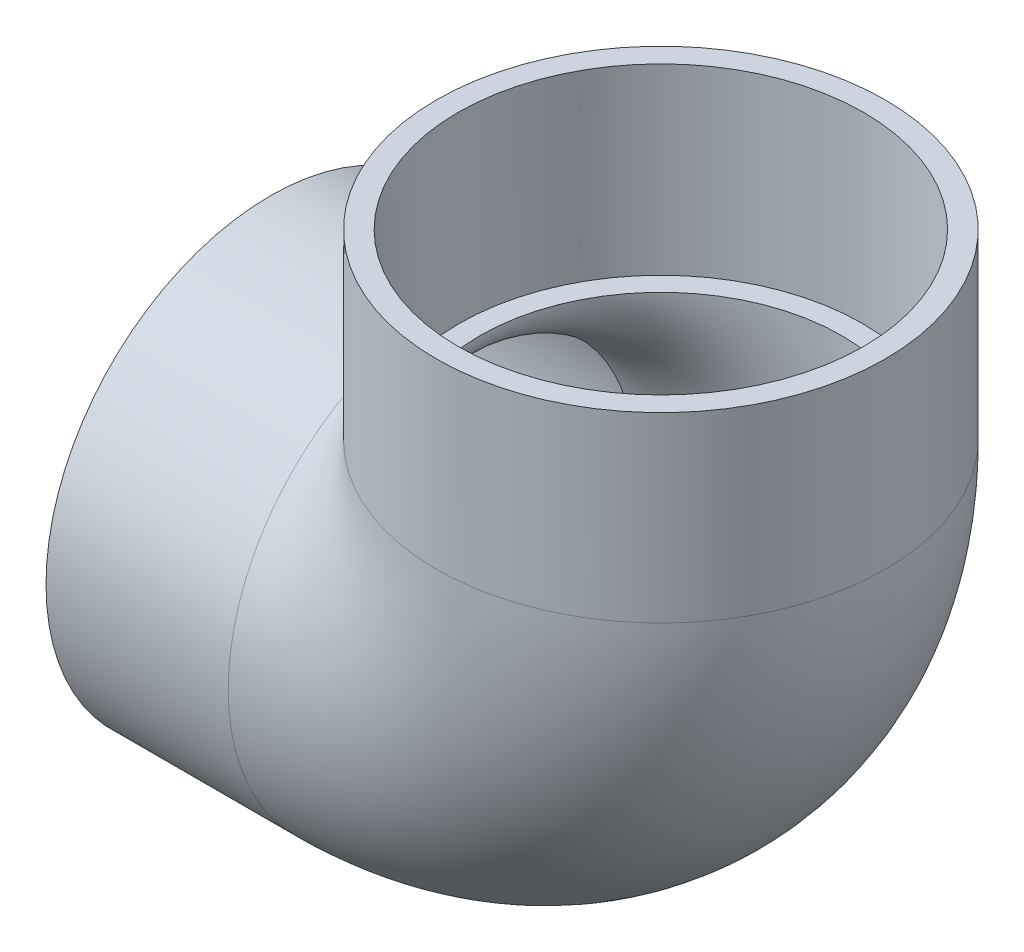
ISO-10303-21;
HEADER;
FILE_DESCRIPTION(('STEP AP214'),'2;1');
FILE_NAME('part.step','',(''),(''),'','','');
FILE_SCHEMA(('AUTOMOTIVE_DESIGN { 1 0 10303 214 1 1 1 1 }'));
ENDSEC;
DATA;
#1=APPLICATION_CONTEXT('core data for automotive mechanical design processes');
#2=APPLICATION_PROTOCOL_DEFINITION('international standard','automotive_design',2000,#1);
#3=PRODUCT_CONTEXT('',#1,'mechanical');
#4=PRODUCT('Part','Part','',(#3));
#5=PRODUCT_RELATED_PRODUCT_CATEGORY('part','',(#4));
#6=PRODUCT_DEFINITION_FORMATION('','',#4);
#7=PRODUCT_DEFINITION_CONTEXT('part definition',#1,'design');
#8=PRODUCT_DEFINITION('design','',#6,#7);
#9=PRODUCT_DEFINITION_SHAPE('','',#8);
#10=(LENGTH_UNIT() NAMED_UNIT(*) SI_UNIT(.MILLI.,.METRE.));
#11=(NAMED_UNIT(*) PLANE_ANGLE_UNIT() SI_UNIT($,.RADIAN.));
#12=(NAMED_UNIT(*) SI_UNIT($,.STERADIAN.) SOLID_ANGLE_UNIT());
#13=UNCERTAINTY_MEASURE_WITH_UNIT(LENGTH_MEASURE(1.E-05),#10,'distance_accuracy_value','');
#14=(GEOMETRIC_REPRESENTATION_CONTEXT(3) GLOBAL_UNCERTAINTY_ASSIGNED_CONTEXT((#13)) GLOBAL_UNIT_ASSIGNED_CONTEXT((#10,
#11,#12)) REPRESENTATION_CONTEXT('',''));
#15=CARTESIAN_POINT('',(0.,0.,0.));
#16=DIRECTION('',(0.,0.,1.));
#17=DIRECTION('',(1.,0.,0.));
#18=AXIS2_PLACEMENT_3D('',#15,#16,#17);
#19=CARTESIAN_POINT('',(-110.49,-63.4999999999999,-1.33226762955019E-12));
#20=DIRECTION('',(-1.,0.,0.));
#21=DIRECTION('',(0.,0.,1.));
#22=AXIS2_PLACEMENT_3D('',#19,#20,#21);
#23=PLANE('',#22);
#24=CARTESIAN_POINT('',(-110.49,0.,-1.33226762955019E-12));
#25=DIRECTION('',(-1.,0.,0.));
#26=DIRECTION('',(0.,0.,1.));
#27=AXIS2_PLACEMENT_3D('',#24,#25,#26);
#28=CIRCLE('',#27,63.5);
#29=CARTESIAN_POINT('',(-110.49,0.,63.4999999999987));
#30=VERTEX_POINT('',#29);
#31=EDGE_CURVE('E52',#30,#30,#28,.T.);
#32=ORIENTED_EDGE('',*,*,#31,.T.);
#33=EDGE_LOOP('',(#32));
#34=FACE_BOUND('',#33,.T.);
#35=CARTESIAN_POINT('',(-110.49,0.,-1.33226762955019E-12));
#36=DIRECTION('',(-1.,0.,0.));
#37=DIRECTION('',(0.,0.,1.));
#38=AXIS2_PLACEMENT_3D('',#35,#36,#37);
#39=CIRCLE('',#38,57.3786);
#40=CARTESIAN_POINT('',(-110.49,0.,57.3785999999987));
#41=VERTEX_POINT('',#40);
#42=EDGE_CURVE('E39',#41,#41,#39,.T.);
#43=ORIENTED_EDGE('',*,*,#42,.F.);
#44=EDGE_LOOP('',(#43));
#45=FACE_BOUND('',#44,.T.);
#46=ADVANCED_FACE('F32',(#34,#45),#23,.T.);
#47=CARTESIAN_POINT('',(-58.9279999999999,0.,-1.33226762955019E-12));
#48=DIRECTION('',(-1.,0.,0.));
#49=DIRECTION('',(0.,0.,1.));
#50=AXIS2_PLACEMENT_3D('',#47,#48,#49);
#51=CONICAL_SURFACE('',#50,57.0357,0.0066501482705858);
#52=ORIENTED_EDGE('',*,*,#42,.T.);
#53=EDGE_LOOP('',(#52));
#54=FACE_BOUND('',#53,.T.);
#55=CARTESIAN_POINT('',(-58.9279999999999,0.,-1.33226762955019E-12));
#56=DIRECTION('',(-1.,0.,0.));
#57=DIRECTION('',(0.,0.,1.));
#58=AXIS2_PLACEMENT_3D('',#55,#56,#57);
#59=CIRCLE('',#58,57.0357);
#60=CARTESIAN_POINT('',(-58.9279999999998,0.,57.0356999999987));
#61=VERTEX_POINT('',#60);
#62=EDGE_CURVE('E63',#61,#61,#59,.T.);
#63=ORIENTED_EDGE('',*,*,#62,.F.);
#64=EDGE_LOOP('',(#63));
#65=FACE_BOUND('',#64,.T.);
#66=ADVANCED_FACE('F72',(#54,#65),#51,.F.);
#67=CARTESIAN_POINT('',(-110.49,0.,-1.33226762955019E-12));
#68=DIRECTION('',(-1.,0.,0.));
#69=DIRECTION('',(0.,0.,1.));
#70=AXIS2_PLACEMENT_3D('',#67,#68,#69);
#71=CYLINDRICAL_SURFACE('',#70,63.5);
#72=CARTESIAN_POINT('',(0.,0.,0.));
#73=DIRECTION('',(-0.707106781186547,-0.707106781186547,0.));
#74=DIRECTION('',(-0.707106781186547,0.707106781186547,0.));
#75=AXIS2_PLACEMENT_3D('',#72,#73,#74);
#76=ELLIPSE('',#75,89.8025612106915,63.5);
#77=CARTESIAN_POINT('',(-58.9279999999999,58.9279999999999,-23.6588422371016));
#78=VERTEX_POINT('',#77);
#79=CARTESIAN_POINT('',(-58.9279999999999,58.9279999999999,23.6588422370989));
#80=VERTEX_POINT('',#79);
#81=EDGE_CURVE('E51',#78,#80,#76,.F.);
#82=ORIENTED_EDGE('',*,*,#81,.F.);
#83=CARTESIAN_POINT('',(-58.9279999999999,0.,-1.33226762955019E-12));
#84=DIRECTION('',(-1.,0.,0.));
#85=DIRECTION('',(0.,0.,1.));
#86=AXIS2_PLACEMENT_3D('',#83,#84,#85);
#87=CIRCLE('',#86,63.5);
#88=EDGE_CURVE('E58',#78,#80,#87,.T.);
#89=ORIENTED_EDGE('',*,*,#88,.T.);
#90=EDGE_LOOP('',(#82,#89));
#91=FACE_BOUND('',#90,.T.);
#92=ORIENTED_EDGE('',*,*,#31,.F.);
#93=EDGE_LOOP('',(#92));
#94=FACE_BOUND('',#93,.T.);
#95=ADVANCED_FACE('F56',(#91,#94),#71,.T.);
#96=CARTESIAN_POINT('',(-58.9279999999999,58.9279999999999,-1.33226762955019E-12));
#97=DIRECTION('',(0.,0.,-1.));
#98=DIRECTION('',(-1.,0.,0.));
#99=AXIS2_PLACEMENT_3D('',#96,#97,#98);
#100=TOROIDAL_SURFACE('',#99,58.928,51.1302);
#101=CARTESIAN_POINT('',(0.,58.9279999999999,0.));
#102=DIRECTION('',(0.,1.,0.));
#103=DIRECTION('',(0.,0.,-1.));
#104=AXIS2_PLACEMENT_3D('',#101,#102,#103);
#105=CIRCLE('',#104,51.1302);
#106=CARTESIAN_POINT('',(51.1302000000001,58.9279999999999,1.15597186995023E-12));
#107=VERTEX_POINT('',#106);
#108=EDGE_CURVE('E53',#107,#107,#105,.T.);
#109=CARTESIAN_POINT('',(-58.9279999999999,0.,-1.33226762955019E-12));
#110=DIRECTION('',(1.,0.,0.));
#111=DIRECTION('',(0.,0.,-1.));
#112=AXIS2_PLACEMENT_3D('',#109,#110,#111);
#113=CIRCLE('',#112,51.1302);
#114=CARTESIAN_POINT('',(-58.9279999999999,-51.1302000000001,-1.33226762955019E-12));
#115=VERTEX_POINT('',#114);
#116=EDGE_CURVE('E59',#115,#115,#113,.T.);
#117=CARTESIAN_POINT('',(-58.9279999999999,58.9279999999999,-1.33226762955019E-12));
#118=DIRECTION('',(0.,0.,-1.));
#119=DIRECTION('',(-1.,0.,0.));
#120=AXIS2_PLACEMENT_3D('',#117,#118,#119);
#121=CIRCLE('',#120,110.0582);
#122=EDGE_CURVE('',#107,#115,#121,.T.);
#123=ORIENTED_EDGE('',*,*,#108,.T.);
#124=ORIENTED_EDGE('',*,*,#116,.F.);
#125=ORIENTED_EDGE('',*,*,#122,.T.);
#126=ORIENTED_EDGE('',*,*,#122,.F.);
#127=EDGE_LOOP('',(#123,#125,#124,#126));
#128=FACE_BOUND('',#127,.T.);
#129=ADVANCED_FACE('F82',(#128),#100,.F.);
#130=CARTESIAN_POINT('',(-117.856,58.9279999999999,-1.45002942986139E-12));
#131=DIRECTION('',(0.,-1.,0.));
#132=DIRECTION('',(-1.,0.,0.));
#133=AXIS2_PLACEMENT_3D('',#130,#131,#132);
#134=CIRCLE('',#133,63.5);
#135=TRIMMED_CURVE('',#134,(PARAMETER_VALUE(-2.7598047993663)),
(PARAMETER_VALUE(2.7598047993663)),.T.,.PARAMETER.);
#136=CARTESIAN_POINT('',(-58.9279999999999,58.9279999999999,-1.33226762955019E-12));
#137=DIRECTION('',(0.,0.,-1.));
#138=AXIS1_PLACEMENT('',#136,#137);
#139=SURFACE_OF_REVOLUTION('',#135,#138);
#140=CARTESIAN_POINT('',(0.,58.9279999999999,0.));
#141=DIRECTION('',(0.,1.,0.));
#142=DIRECTION('',(0.,0.,-1.));
#143=AXIS2_PLACEMENT_3D('',#140,#141,#142);
#144=CIRCLE('',#143,63.5);
#145=EDGE_CURVE('E45',#80,#78,#144,.T.);
#146=ORIENTED_EDGE('',*,*,#145,.F.);
#147=ORIENTED_EDGE('',*,*,#88,.F.);
#148=EDGE_LOOP('',(#146,#147));
#149=FACE_BOUND('',#148,.T.);
#150=ADVANCED_FACE('F62',(#149),#139,.T.);
#151=CARTESIAN_POINT('',(0.,58.9279999999999,0.));
#152=DIRECTION('',(0.,1.,0.));
#153=DIRECTION('',(0.,0.,-1.));
#154=AXIS2_PLACEMENT_3D('',#151,#152,#153);
#155=PLANE('',#154);
#156=CARTESIAN_POINT('',(0.,58.9279999999999,0.));
#157=DIRECTION('',(0.,1.,0.));
#158=DIRECTION('',(-1.,0.,0.));
#159=AXIS2_PLACEMENT_3D('',#156,#157,#158);
#160=CIRCLE('',#159,57.0357);
#161=CARTESIAN_POINT('',(-57.0357,58.9279999999999,-1.13980225258103E-13));
#162=VERTEX_POINT('',#161);
#163=EDGE_CURVE('E11',#162,#162,#160,.F.);
#164=ORIENTED_EDGE('',*,*,#163,.F.);
#165=EDGE_LOOP('',(#164));
#166=FACE_BOUND('',#165,.T.);
#167=ORIENTED_EDGE('',*,*,#108,.F.);
#168=EDGE_LOOP('',(#167));
#169=FACE_BOUND('',#168,.T.);
#170=ADVANCED_FACE('F89',(#166,#169),#155,.T.);
#171=CARTESIAN_POINT('',(-58.9279999999999,0.,-1.33226762955019E-12));
#172=DIRECTION('',(1.,0.,0.));
#173=DIRECTION('',(0.,0.,-1.));
#174=AXIS2_PLACEMENT_3D('',#171,#172,#173);
#175=PLANE('',#174);
#176=ORIENTED_EDGE('',*,*,#62,.T.);
#177=EDGE_LOOP('',(#176));
#178=FACE_BOUND('',#177,.T.);
#179=ORIENTED_EDGE('',*,*,#116,.T.);
#180=EDGE_LOOP('',(#179));
#181=FACE_BOUND('',#180,.T.);
#182=ADVANCED_FACE('F92',(#178,#181),#175,.F.);
#183=CARTESIAN_POINT('',(63.4999999999999,110.490000000001,0.));
#184=DIRECTION('',(0.,1.,0.));
#185=DIRECTION('',(0.,0.,1.));
#186=AXIS2_PLACEMENT_3D('',#183,#184,#185);
#187=PLANE('',#186);
#188=CARTESIAN_POINT('',(0.,110.49,0.));
#189=DIRECTION('',(0.,-1.,0.));
#190=DIRECTION('',(0.,0.,-1.));
#191=AXIS2_PLACEMENT_3D('',#188,#189,#190);
#192=CIRCLE('',#191,57.3786);
#193=CARTESIAN_POINT('',(-1.14665477113363E-13,110.49,-57.3786));
#194=VERTEX_POINT('',#193);
#195=EDGE_CURVE('E116',#194,#194,#192,.T.);
#196=ORIENTED_EDGE('',*,*,#195,.T.);
#197=EDGE_LOOP('',(#196));
#198=FACE_BOUND('',#197,.T.);
#199=CARTESIAN_POINT('',(0.,110.49,0.));
#200=DIRECTION('',(0.,-1.,0.));
#201=DIRECTION('',(0.,0.,-1.));
#202=AXIS2_PLACEMENT_3D('',#199,#200,#201);
#203=CIRCLE('',#202,63.5);
#204=CARTESIAN_POINT('',(-1.26898491714655E-13,110.49,-63.5));
#205=VERTEX_POINT('',#204);
#206=EDGE_CURVE('E60',#205,#205,#203,.T.);
#207=ORIENTED_EDGE('',*,*,#206,.F.);
#208=EDGE_LOOP('',(#207));
#209=FACE_BOUND('',#208,.T.);
#210=ADVANCED_FACE('F99',(#198,#209),#187,.T.);
#211=CARTESIAN_POINT('',(0.,0.,0.));
#212=DIRECTION('',(0.,-1.,0.));
#213=DIRECTION('',(0.,0.,-1.));
#214=AXIS2_PLACEMENT_3D('',#211,#212,#213);
#215=CYLINDRICAL_SURFACE('',#214,63.5);
#216=ORIENTED_EDGE('',*,*,#206,.T.);
#217=EDGE_LOOP('',(#216));
#218=FACE_BOUND('',#217,.T.);
#219=ORIENTED_EDGE('',*,*,#145,.T.);
#220=ORIENTED_EDGE('',*,*,#81,.T.);
#221=EDGE_LOOP('',(#219,#220));
#222=FACE_BOUND('',#221,.T.);
#223=ADVANCED_FACE('F50',(#218,#222),#215,.T.);
#224=CARTESIAN_POINT('',(0.,110.49,0.));
#225=DIRECTION('',(0.,1.,0.));
#226=DIRECTION('',(0.,0.,1.));
#227=AXIS2_PLACEMENT_3D('',#224,#225,#226);
#228=CONICAL_SURFACE('',#227,57.3786,0.0066501482705858);
#229=ORIENTED_EDGE('',*,*,#163,.T.);
#230=EDGE_LOOP('',(#229));
#231=FACE_BOUND('',#230,.T.);
#232=ORIENTED_EDGE('',*,*,#195,.F.);
#233=EDGE_LOOP('',(#232));
#234=FACE_BOUND('',#233,.T.);
#235=ADVANCED_FACE('F106',(#231,#234),#228,.F.);
#236=CLOSED_SHELL('',(#46,#66,#95,#129,#150,#170,#182,#210,#223,#235));
#237=MANIFOLD_SOLID_BREP('B2',#236);
#238=ADVANCED_BREP_SHAPE_REPRESENTATION('',(#18,#237),#14);
#239=SHAPE_DEFINITION_REPRESENTATION(#9,#238);
ENDSEC;
END-ISO-10303-21;
